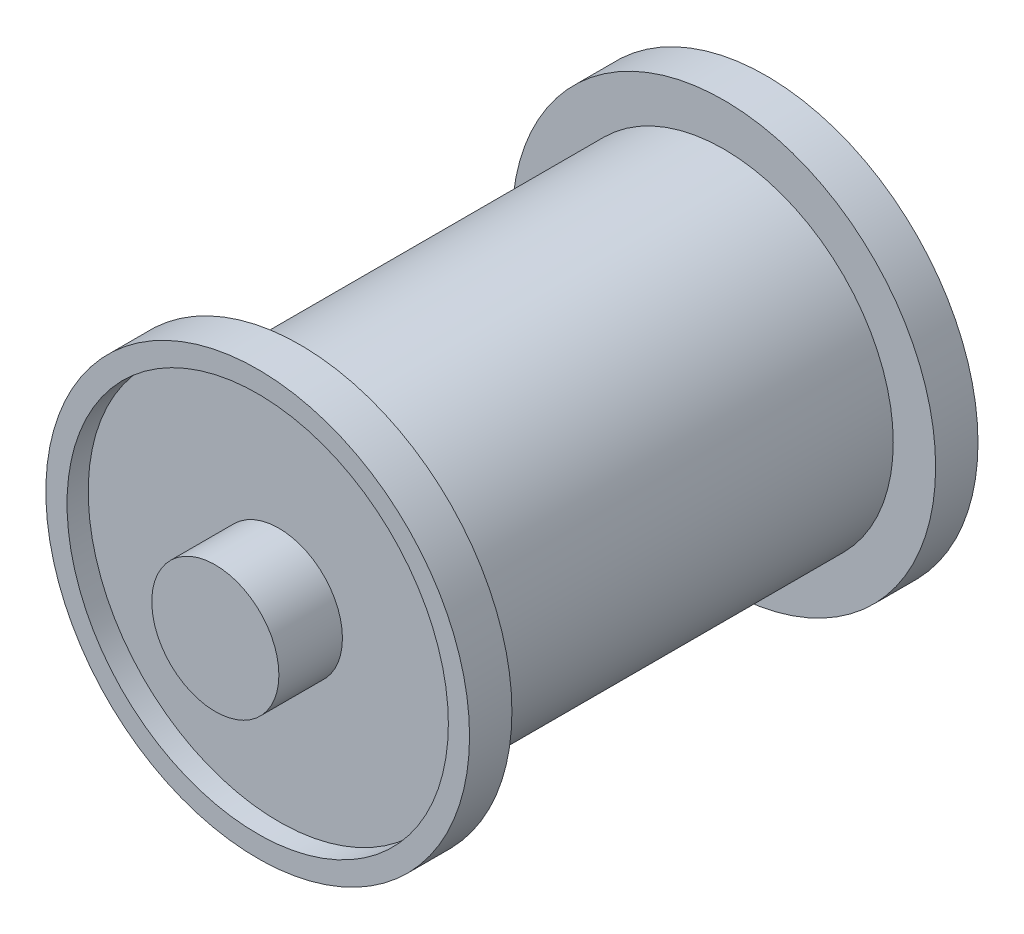
ISO-10303-21;
HEADER;
FILE_DESCRIPTION(('STEP AP214'),'2;1');
FILE_NAME('part.step','',(''),(''),'','','');
FILE_SCHEMA(('AUTOMOTIVE_DESIGN { 1 0 10303 214 1 1 1 1 }'));
ENDSEC;
DATA;
#1=APPLICATION_CONTEXT('core data for automotive mechanical design processes');
#2=APPLICATION_PROTOCOL_DEFINITION('international standard','automotive_design',2000,#1);
#3=PRODUCT_CONTEXT('',#1,'mechanical');
#4=PRODUCT('Part','Part','',(#3));
#5=PRODUCT_RELATED_PRODUCT_CATEGORY('part','',(#4));
#6=PRODUCT_DEFINITION_FORMATION('','',#4);
#7=PRODUCT_DEFINITION_CONTEXT('part definition',#1,'design');
#8=PRODUCT_DEFINITION('design','',#6,#7);
#9=PRODUCT_DEFINITION_SHAPE('','',#8);
#10=(LENGTH_UNIT() NAMED_UNIT(*) SI_UNIT(.MILLI.,.METRE.));
#11=(NAMED_UNIT(*) PLANE_ANGLE_UNIT() SI_UNIT($,.RADIAN.));
#12=(NAMED_UNIT(*) SI_UNIT($,.STERADIAN.) SOLID_ANGLE_UNIT());
#13=UNCERTAINTY_MEASURE_WITH_UNIT(LENGTH_MEASURE(1.E-05),#10,'distance_accuracy_value','');
#14=(GEOMETRIC_REPRESENTATION_CONTEXT(3) GLOBAL_UNCERTAINTY_ASSIGNED_CONTEXT((#13)) GLOBAL_UNIT_ASSIGNED_CONTEXT((#10,
#11,#12)) REPRESENTATION_CONTEXT('',''));
#15=CARTESIAN_POINT('',(0.,0.,0.));
#16=DIRECTION('',(0.,0.,1.));
#17=DIRECTION('',(1.,0.,0.));
#18=AXIS2_PLACEMENT_3D('',#15,#16,#17);
#19=CARTESIAN_POINT('',(0.,0.,1.));
#20=DIRECTION('',(0.,0.,1.));
#21=DIRECTION('',(1.,0.,0.));
#22=AXIS2_PLACEMENT_3D('',#19,#20,#21);
#23=PLANE('',#22);
#24=CARTESIAN_POINT('',(0.,0.,1.));
#25=DIRECTION('',(0.,0.,1.));
#26=DIRECTION('',(1.,0.,0.));
#27=AXIS2_PLACEMENT_3D('',#24,#25,#26);
#28=CIRCLE('',#27,9.);
#29=CARTESIAN_POINT('',(9.,0.,1.));
#30=VERTEX_POINT('',#29);
#31=EDGE_CURVE('E62',#30,#30,#28,.T.);
#32=ORIENTED_EDGE('',*,*,#31,.T.);
#33=EDGE_LOOP('',(#32));
#34=FACE_BOUND('',#33,.T.);
#35=CARTESIAN_POINT('',(0.,0.,1.));
#36=DIRECTION('',(0.,0.,1.));
#37=DIRECTION('',(1.,0.,0.));
#38=AXIS2_PLACEMENT_3D('',#35,#36,#37);
#39=CIRCLE('',#38,3.);
#40=CARTESIAN_POINT('',(3.,0.,1.));
#41=VERTEX_POINT('',#40);
#42=EDGE_CURVE('E81',#41,#41,#39,.T.);
#43=ORIENTED_EDGE('',*,*,#42,.F.);
#44=EDGE_LOOP('',(#43));
#45=FACE_BOUND('',#44,.T.);
#46=ADVANCED_FACE('F42',(#34,#45),#23,.T.);
#47=CARTESIAN_POINT('',(0.,0.,0.));
#48=DIRECTION('',(0.,0.,1.));
#49=DIRECTION('',(1.,0.,0.));
#50=AXIS2_PLACEMENT_3D('',#47,#48,#49);
#51=PLANE('',#50);
#52=CARTESIAN_POINT('',(0.,0.,0.));
#53=DIRECTION('',(0.,0.,1.));
#54=DIRECTION('',(1.,0.,0.));
#55=AXIS2_PLACEMENT_3D('',#52,#53,#54);
#56=CIRCLE('',#55,10.);
#57=CARTESIAN_POINT('',(10.,0.,0.));
#58=VERTEX_POINT('',#57);
#59=EDGE_CURVE('E53',#58,#58,#56,.T.);
#60=ORIENTED_EDGE('',*,*,#59,.F.);
#61=EDGE_LOOP('',(#60));
#62=FACE_BOUND('',#61,.T.);
#63=CARTESIAN_POINT('',(0.,0.,0.));
#64=DIRECTION('',(0.,0.,1.));
#65=DIRECTION('',(1.,0.,0.));
#66=AXIS2_PLACEMENT_3D('',#63,#64,#65);
#67=CIRCLE('',#66,8.);
#68=CARTESIAN_POINT('',(8.,0.,0.));
#69=VERTEX_POINT('',#68);
#70=EDGE_CURVE('E12',#69,#69,#67,.F.);
#71=ORIENTED_EDGE('',*,*,#70,.F.);
#72=EDGE_LOOP('',(#71));
#73=FACE_BOUND('',#72,.T.);
#74=ADVANCED_FACE('F97',(#62,#73),#51,.F.);
#75=CARTESIAN_POINT('',(0.,0.,2.));
#76=DIRECTION('',(0.,0.,-1.));
#77=DIRECTION('',(-1.,0.,0.));
#78=AXIS2_PLACEMENT_3D('',#75,#76,#77);
#79=CYLINDRICAL_SURFACE('',#78,10.);
#80=CARTESIAN_POINT('',(0.,0.,2.));
#81=DIRECTION('',(0.,0.,1.));
#82=DIRECTION('',(1.,0.,0.));
#83=AXIS2_PLACEMENT_3D('',#80,#81,#82);
#84=CIRCLE('',#83,10.);
#85=CARTESIAN_POINT('',(10.,0.,2.));
#86=VERTEX_POINT('',#85);
#87=EDGE_CURVE('E49',#86,#86,#84,.T.);
#88=ORIENTED_EDGE('',*,*,#87,.F.);
#89=EDGE_LOOP('',(#88));
#90=FACE_BOUND('',#89,.T.);
#91=ORIENTED_EDGE('',*,*,#59,.T.);
#92=EDGE_LOOP('',(#91));
#93=FACE_BOUND('',#92,.T.);
#94=ADVANCED_FACE('F44',(#90,#93),#79,.T.);
#95=CARTESIAN_POINT('',(0.,0.,2.));
#96=DIRECTION('',(0.,0.,1.));
#97=DIRECTION('',(1.,0.,0.));
#98=AXIS2_PLACEMENT_3D('',#95,#96,#97);
#99=PLANE('',#98);
#100=CARTESIAN_POINT('',(0.,0.,2.));
#101=DIRECTION('',(0.,0.,1.));
#102=DIRECTION('',(1.,0.,0.));
#103=AXIS2_PLACEMENT_3D('',#100,#101,#102);
#104=CIRCLE('',#103,9.);
#105=CARTESIAN_POINT('',(9.,0.,2.));
#106=VERTEX_POINT('',#105);
#107=EDGE_CURVE('E58',#106,#106,#104,.T.);
#108=ORIENTED_EDGE('',*,*,#107,.F.);
#109=EDGE_LOOP('',(#108));
#110=FACE_BOUND('',#109,.T.);
#111=ORIENTED_EDGE('',*,*,#87,.T.);
#112=EDGE_LOOP('',(#111));
#113=FACE_BOUND('',#112,.T.);
#114=ADVANCED_FACE('F108',(#110,#113),#99,.T.);
#115=CARTESIAN_POINT('',(0.,0.,2.));
#116=DIRECTION('',(0.,0.,-1.));
#117=DIRECTION('',(-1.,0.,0.));
#118=AXIS2_PLACEMENT_3D('',#115,#116,#117);
#119=CYLINDRICAL_SURFACE('',#118,9.);
#120=ORIENTED_EDGE('',*,*,#107,.T.);
#121=EDGE_LOOP('',(#120));
#122=FACE_BOUND('',#121,.T.);
#123=ORIENTED_EDGE('',*,*,#31,.F.);
#124=EDGE_LOOP('',(#123));
#125=FACE_BOUND('',#124,.T.);
#126=ADVANCED_FACE('F106',(#122,#125),#119,.F.);
#127=CARTESIAN_POINT('',(0.,0.,-10.));
#128=DIRECTION('',(0.,0.,1.));
#129=DIRECTION('',(1.,0.,0.));
#130=AXIS2_PLACEMENT_3D('',#127,#128,#129);
#131=CYLINDRICAL_SURFACE('',#130,8.);
#132=ORIENTED_EDGE('',*,*,#70,.T.);
#133=EDGE_LOOP('',(#132));
#134=FACE_BOUND('',#133,.T.);
#135=CARTESIAN_POINT('',(0.,0.,-20.));
#136=DIRECTION('',(0.,0.,1.));
#137=DIRECTION('',(1.,0.,0.));
#138=AXIS2_PLACEMENT_3D('',#135,#136,#137);
#139=CIRCLE('',#138,8.);
#140=CARTESIAN_POINT('',(8.,0.,-20.));
#141=VERTEX_POINT('',#140);
#142=EDGE_CURVE('E65',#141,#141,#139,.F.);
#143=ORIENTED_EDGE('',*,*,#142,.F.);
#144=EDGE_LOOP('',(#143));
#145=FACE_BOUND('',#144,.T.);
#146=ADVANCED_FACE('F115',(#134,#145),#131,.T.);
#147=CARTESIAN_POINT('',(0.,0.,-20.));
#148=DIRECTION('',(0.,0.,-1.));
#149=DIRECTION('',(1.,0.,0.));
#150=AXIS2_PLACEMENT_3D('',#147,#148,#149);
#151=PLANE('',#150);
#152=CARTESIAN_POINT('',(0.,0.,-20.));
#153=DIRECTION('',(0.,0.,1.));
#154=DIRECTION('',(1.,0.,0.));
#155=AXIS2_PLACEMENT_3D('',#152,#153,#154);
#156=CIRCLE('',#155,10.);
#157=CARTESIAN_POINT('',(10.,0.,-20.));
#158=VERTEX_POINT('',#157);
#159=EDGE_CURVE('E69',#158,#158,#156,.T.);
#160=ORIENTED_EDGE('',*,*,#159,.T.);
#161=EDGE_LOOP('',(#160));
#162=FACE_BOUND('',#161,.T.);
#163=ORIENTED_EDGE('',*,*,#142,.T.);
#164=EDGE_LOOP('',(#163));
#165=FACE_BOUND('',#164,.T.);
#166=ADVANCED_FACE('F140',(#162,#165),#151,.F.);
#167=CARTESIAN_POINT('',(0.,0.,-22.));
#168=DIRECTION('',(0.,0.,1.));
#169=DIRECTION('',(-1.,0.,0.));
#170=AXIS2_PLACEMENT_3D('',#167,#168,#169);
#171=CYLINDRICAL_SURFACE('',#170,10.);
#172=CARTESIAN_POINT('',(0.,0.,-22.));
#173=DIRECTION('',(0.,0.,1.));
#174=DIRECTION('',(1.,0.,0.));
#175=AXIS2_PLACEMENT_3D('',#172,#173,#174);
#176=CIRCLE('',#175,10.);
#177=CARTESIAN_POINT('',(10.,0.,-22.));
#178=VERTEX_POINT('',#177);
#179=EDGE_CURVE('E68',#178,#178,#176,.T.);
#180=ORIENTED_EDGE('',*,*,#179,.T.);
#181=EDGE_LOOP('',(#180));
#182=FACE_BOUND('',#181,.T.);
#183=ORIENTED_EDGE('',*,*,#159,.F.);
#184=EDGE_LOOP('',(#183));
#185=FACE_BOUND('',#184,.T.);
#186=ADVANCED_FACE('F155',(#182,#185),#171,.T.);
#187=CARTESIAN_POINT('',(0.,0.,-22.));
#188=DIRECTION('',(0.,0.,-1.));
#189=DIRECTION('',(1.,0.,0.));
#190=AXIS2_PLACEMENT_3D('',#187,#188,#189);
#191=PLANE('',#190);
#192=CARTESIAN_POINT('',(0.,0.,-22.));
#193=DIRECTION('',(0.,0.,1.));
#194=DIRECTION('',(1.,0.,0.));
#195=AXIS2_PLACEMENT_3D('',#192,#193,#194);
#196=CIRCLE('',#195,9.);
#197=CARTESIAN_POINT('',(9.,0.,-22.));
#198=VERTEX_POINT('',#197);
#199=EDGE_CURVE('E72',#198,#198,#196,.T.);
#200=ORIENTED_EDGE('',*,*,#199,.T.);
#201=EDGE_LOOP('',(#200));
#202=FACE_BOUND('',#201,.T.);
#203=ORIENTED_EDGE('',*,*,#179,.F.);
#204=EDGE_LOOP('',(#203));
#205=FACE_BOUND('',#204,.T.);
#206=ADVANCED_FACE('F164',(#202,#205),#191,.T.);
#207=CARTESIAN_POINT('',(0.,0.,-22.));
#208=DIRECTION('',(0.,0.,1.));
#209=DIRECTION('',(-1.,0.,0.));
#210=AXIS2_PLACEMENT_3D('',#207,#208,#209);
#211=CYLINDRICAL_SURFACE('',#210,9.);
#212=ORIENTED_EDGE('',*,*,#199,.F.);
#213=EDGE_LOOP('',(#212));
#214=FACE_BOUND('',#213,.T.);
#215=CARTESIAN_POINT('',(0.,0.,-21.));
#216=DIRECTION('',(0.,0.,1.));
#217=DIRECTION('',(1.,0.,0.));
#218=AXIS2_PLACEMENT_3D('',#215,#216,#217);
#219=CIRCLE('',#218,9.);
#220=CARTESIAN_POINT('',(9.,0.,-21.));
#221=VERTEX_POINT('',#220);
#222=EDGE_CURVE('E77',#221,#221,#219,.T.);
#223=ORIENTED_EDGE('',*,*,#222,.T.);
#224=EDGE_LOOP('',(#223));
#225=FACE_BOUND('',#224,.T.);
#226=ADVANCED_FACE('F173',(#214,#225),#211,.F.);
#227=CARTESIAN_POINT('',(0.,0.,-21.));
#228=DIRECTION('',(0.,0.,-1.));
#229=DIRECTION('',(1.,0.,0.));
#230=AXIS2_PLACEMENT_3D('',#227,#228,#229);
#231=PLANE('',#230);
#232=ORIENTED_EDGE('',*,*,#222,.F.);
#233=EDGE_LOOP('',(#232));
#234=FACE_BOUND('',#233,.T.);
#235=ADVANCED_FACE('F92',(#234),#231,.T.);
#236=CARTESIAN_POINT('',(0.,0.,4.));
#237=DIRECTION('',(0.,0.,-1.));
#238=DIRECTION('',(-1.,0.,0.));
#239=AXIS2_PLACEMENT_3D('',#236,#237,#238);
#240=CYLINDRICAL_SURFACE('',#239,3.);
#241=CARTESIAN_POINT('',(0.,0.,4.));
#242=DIRECTION('',(0.,0.,1.));
#243=DIRECTION('',(1.,0.,0.));
#244=AXIS2_PLACEMENT_3D('',#241,#242,#243);
#245=CIRCLE('',#244,3.);
#246=CARTESIAN_POINT('',(3.,0.,4.));
#247=VERTEX_POINT('',#246);
#248=EDGE_CURVE('E80',#247,#247,#245,.T.);
#249=ORIENTED_EDGE('',*,*,#248,.F.);
#250=EDGE_LOOP('',(#249));
#251=FACE_BOUND('',#250,.T.);
#252=ORIENTED_EDGE('',*,*,#42,.T.);
#253=EDGE_LOOP('',(#252));
#254=FACE_BOUND('',#253,.T.);
#255=ADVANCED_FACE('F89',(#251,#254),#240,.T.);
#256=CARTESIAN_POINT('',(0.,0.,4.));
#257=DIRECTION('',(0.,0.,1.));
#258=DIRECTION('',(1.,0.,0.));
#259=AXIS2_PLACEMENT_3D('',#256,#257,#258);
#260=PLANE('',#259);
#261=ORIENTED_EDGE('',*,*,#248,.T.);
#262=EDGE_LOOP('',(#261));
#263=FACE_BOUND('',#262,.T.);
#264=ADVANCED_FACE('F87',(#263),#260,.T.);
#265=CLOSED_SHELL('',(#46,#74,#94,#114,#126,#146,#166,#186,#206,#226,#235,#255,#264));
#266=MANIFOLD_SOLID_BREP('B2',#265);
#267=ADVANCED_BREP_SHAPE_REPRESENTATION('',(#18,#266),#14);
#268=SHAPE_DEFINITION_REPRESENTATION(#9,#267);
ENDSEC;
END-ISO-10303-21;
